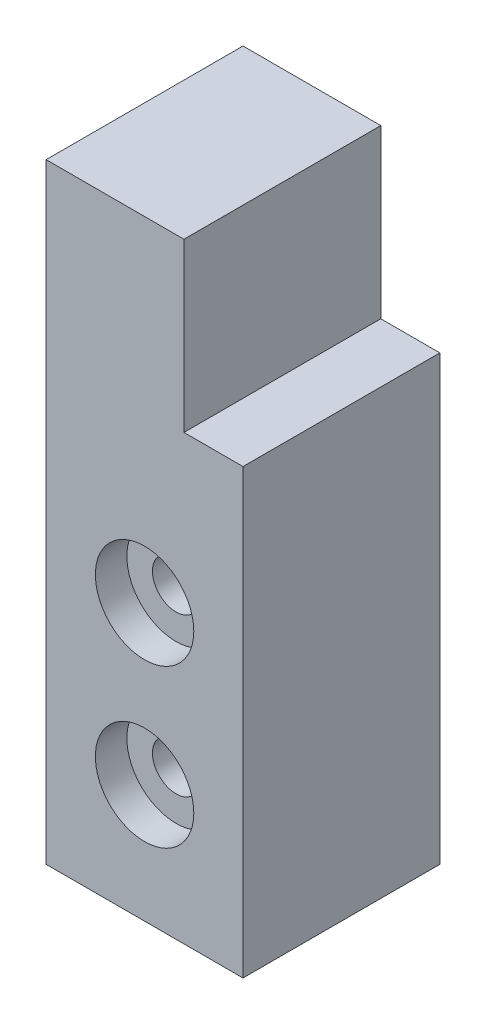
ISO-10303-21;
HEADER;
FILE_DESCRIPTION(('STEP AP214'),'2;1');
FILE_NAME('part.step','',(''),(''),'','','');
FILE_SCHEMA(('AUTOMOTIVE_DESIGN { 1 0 10303 214 1 1 1 1 }'));
ENDSEC;
DATA;
#1=APPLICATION_CONTEXT('core data for automotive mechanical design processes');
#2=APPLICATION_PROTOCOL_DEFINITION('international standard','automotive_design',2000,#1);
#3=PRODUCT_CONTEXT('',#1,'mechanical');
#4=PRODUCT('Part','Part','',(#3));
#5=PRODUCT_RELATED_PRODUCT_CATEGORY('part','',(#4));
#6=PRODUCT_DEFINITION_FORMATION('','',#4);
#7=PRODUCT_DEFINITION_CONTEXT('part definition',#1,'design');
#8=PRODUCT_DEFINITION('design','',#6,#7);
#9=PRODUCT_DEFINITION_SHAPE('','',#8);
#10=(LENGTH_UNIT() NAMED_UNIT(*) SI_UNIT(.MILLI.,.METRE.));
#11=(NAMED_UNIT(*) PLANE_ANGLE_UNIT() SI_UNIT($,.RADIAN.));
#12=(NAMED_UNIT(*) SI_UNIT($,.STERADIAN.) SOLID_ANGLE_UNIT());
#13=UNCERTAINTY_MEASURE_WITH_UNIT(LENGTH_MEASURE(1.E-05),#10,'distance_accuracy_value','');
#14=(GEOMETRIC_REPRESENTATION_CONTEXT(3) GLOBAL_UNCERTAINTY_ASSIGNED_CONTEXT((#13)) GLOBAL_UNIT_ASSIGNED_CONTEXT((#10,
#11,#12)) REPRESENTATION_CONTEXT('',''));
#15=CARTESIAN_POINT('',(0.,0.,0.));
#16=DIRECTION('',(0.,0.,1.));
#17=DIRECTION('',(1.,0.,0.));
#18=AXIS2_PLACEMENT_3D('',#15,#16,#17);
#19=CARTESIAN_POINT('',(0.,0.,10.));
#20=DIRECTION('',(1.,0.,0.));
#21=DIRECTION('',(0.,0.,-1.));
#22=AXIS2_PLACEMENT_3D('',#19,#20,#21);
#23=PLANE('',#22);
#24=DIRECTION('',(0.,-1.,0.));
#25=VECTOR('',#24,1.);
#26=CARTESIAN_POINT('',(0.,0.,0.));
#27=LINE('',#26,#25);
#28=CARTESIAN_POINT('',(0.,31.,0.));
#29=VERTEX_POINT('',#28);
#30=CARTESIAN_POINT('',(0.,0.,0.));
#31=VERTEX_POINT('',#30);
#32=EDGE_CURVE('E109',#29,#31,#27,.T.);
#33=ORIENTED_EDGE('',*,*,#32,.T.);
#34=DIRECTION('',(0.,0.,-1.));
#35=VECTOR('',#34,1.);
#36=CARTESIAN_POINT('',(0.,0.,10.));
#37=LINE('',#36,#35);
#38=CARTESIAN_POINT('',(0.,0.,10.));
#39=VERTEX_POINT('',#38);
#40=EDGE_CURVE('E11',#39,#31,#37,.T.);
#41=ORIENTED_EDGE('',*,*,#40,.F.);
#42=DIRECTION('',(0.,-1.,0.));
#43=VECTOR('',#42,1.);
#44=CARTESIAN_POINT('',(0.,0.,10.));
#45=LINE('',#44,#43);
#46=CARTESIAN_POINT('',(0.,31.,10.));
#47=VERTEX_POINT('',#46);
#48=EDGE_CURVE('E110',#47,#39,#45,.T.);
#49=ORIENTED_EDGE('',*,*,#48,.F.);
#50=DIRECTION('',(0.,0.,-1.));
#51=VECTOR('',#50,1.);
#52=CARTESIAN_POINT('',(0.,31.,10.));
#53=LINE('',#52,#51);
#54=EDGE_CURVE('E119',#47,#29,#53,.T.);
#55=ORIENTED_EDGE('',*,*,#54,.T.);
#56=EDGE_LOOP('',(#33,#41,#49,#55));
#57=FACE_BOUND('',#56,.T.);
#58=ADVANCED_FACE('F35',(#57),#23,.F.);
#59=CARTESIAN_POINT('',(0.,0.,10.));
#60=DIRECTION('',(0.,1.,0.));
#61=DIRECTION('',(0.,0.,1.));
#62=AXIS2_PLACEMENT_3D('',#59,#60,#61);
#63=PLANE('',#62);
#64=DIRECTION('',(1.,0.,0.));
#65=VECTOR('',#64,1.);
#66=CARTESIAN_POINT('',(0.,0.,0.));
#67=LINE('',#66,#65);
#68=CARTESIAN_POINT('',(10.,0.,0.));
#69=VERTEX_POINT('',#68);
#70=EDGE_CURVE('E115',#31,#69,#67,.T.);
#71=ORIENTED_EDGE('',*,*,#70,.T.);
#72=DIRECTION('',(0.,0.,-1.));
#73=VECTOR('',#72,1.);
#74=CARTESIAN_POINT('',(10.,0.,10.));
#75=LINE('',#74,#73);
#76=CARTESIAN_POINT('',(10.,0.,10.));
#77=VERTEX_POINT('',#76);
#78=EDGE_CURVE('E42',#77,#69,#75,.T.);
#79=ORIENTED_EDGE('',*,*,#78,.F.);
#80=DIRECTION('',(1.,0.,0.));
#81=VECTOR('',#80,1.);
#82=CARTESIAN_POINT('',(0.,0.,10.));
#83=LINE('',#82,#81);
#84=EDGE_CURVE('E81',#39,#77,#83,.T.);
#85=ORIENTED_EDGE('',*,*,#84,.F.);
#86=ORIENTED_EDGE('',*,*,#40,.T.);
#87=EDGE_LOOP('',(#71,#79,#85,#86));
#88=FACE_BOUND('',#87,.T.);
#89=ADVANCED_FACE('F141',(#88),#63,.F.);
#90=CARTESIAN_POINT('',(10.,0.,10.));
#91=DIRECTION('',(-1.,0.,0.));
#92=DIRECTION('',(0.,0.,1.));
#93=AXIS2_PLACEMENT_3D('',#90,#91,#92);
#94=PLANE('',#93);
#95=DIRECTION('',(0.,1.,0.));
#96=VECTOR('',#95,1.);
#97=CARTESIAN_POINT('',(10.,0.,0.));
#98=LINE('',#97,#96);
#99=CARTESIAN_POINT('',(10.,22.5,0.));
#100=VERTEX_POINT('',#99);
#101=EDGE_CURVE('E111',#69,#100,#98,.T.);
#102=ORIENTED_EDGE('',*,*,#101,.T.);
#103=DIRECTION('',(0.,0.,1.));
#104=VECTOR('',#103,1.);
#105=CARTESIAN_POINT('',(10.,22.5,0.));
#106=LINE('',#105,#104);
#107=CARTESIAN_POINT('',(10.,22.5,10.));
#108=VERTEX_POINT('',#107);
#109=EDGE_CURVE('E135',#100,#108,#106,.T.);
#110=ORIENTED_EDGE('',*,*,#109,.T.);
#111=DIRECTION('',(0.,1.,0.));
#112=VECTOR('',#111,1.);
#113=CARTESIAN_POINT('',(10.,0.,10.));
#114=LINE('',#113,#112);
#115=EDGE_CURVE('E127',#77,#108,#114,.T.);
#116=ORIENTED_EDGE('',*,*,#115,.F.);
#117=ORIENTED_EDGE('',*,*,#78,.T.);
#118=EDGE_LOOP('',(#102,#110,#116,#117));
#119=FACE_BOUND('',#118,.T.);
#120=ADVANCED_FACE('F124',(#119),#94,.F.);
#121=CARTESIAN_POINT('',(0.,31.,10.));
#122=DIRECTION('',(0.,-1.,0.));
#123=DIRECTION('',(0.,0.,-1.));
#124=AXIS2_PLACEMENT_3D('',#121,#122,#123);
#125=PLANE('',#124);
#126=DIRECTION('',(-1.,0.,0.));
#127=VECTOR('',#126,1.);
#128=CARTESIAN_POINT('',(0.,31.,10.));
#129=LINE('',#128,#127);
#130=CARTESIAN_POINT('',(7.,31.,10.));
#131=VERTEX_POINT('',#130);
#132=EDGE_CURVE('E58',#131,#47,#129,.T.);
#133=ORIENTED_EDGE('',*,*,#132,.F.);
#134=DIRECTION('',(0.,0.,1.));
#135=VECTOR('',#134,1.);
#136=CARTESIAN_POINT('',(7.,31.,0.));
#137=LINE('',#136,#135);
#138=CARTESIAN_POINT('',(7.,31.,0.));
#139=VERTEX_POINT('',#138);
#140=EDGE_CURVE('E99',#139,#131,#137,.T.);
#141=ORIENTED_EDGE('',*,*,#140,.F.);
#142=DIRECTION('',(-1.,0.,0.));
#143=VECTOR('',#142,1.);
#144=CARTESIAN_POINT('',(0.,31.,0.));
#145=LINE('',#144,#143);
#146=EDGE_CURVE('E76',#139,#29,#145,.T.);
#147=ORIENTED_EDGE('',*,*,#146,.T.);
#148=ORIENTED_EDGE('',*,*,#54,.F.);
#149=EDGE_LOOP('',(#133,#141,#147,#148));
#150=FACE_BOUND('',#149,.T.);
#151=ADVANCED_FACE('F104',(#150),#125,.F.);
#152=CARTESIAN_POINT('',(0.,0.,10.));
#153=DIRECTION('',(0.,0.,-1.));
#154=DIRECTION('',(-1.,0.,0.));
#155=AXIS2_PLACEMENT_3D('',#152,#153,#154);
#156=PLANE('',#155);
#157=CARTESIAN_POINT('',(5.,14.,10.));
#158=DIRECTION('',(0.,0.,1.));
#159=DIRECTION('',(1.,0.,0.));
#160=AXIS2_PLACEMENT_3D('',#157,#158,#159);
#161=CIRCLE('',#160,2.5);
#162=CARTESIAN_POINT('',(7.5,14.,10.));
#163=VERTEX_POINT('',#162);
#164=EDGE_CURVE('E177',#163,#163,#161,.T.);
#165=ORIENTED_EDGE('',*,*,#164,.F.);
#166=EDGE_LOOP('',(#165));
#167=FACE_BOUND('',#166,.T.);
#168=CARTESIAN_POINT('',(5.,6.,10.));
#169=DIRECTION('',(0.,0.,1.));
#170=DIRECTION('',(1.,0.,0.));
#171=AXIS2_PLACEMENT_3D('',#168,#169,#170);
#172=CIRCLE('',#171,2.5);
#173=CARTESIAN_POINT('',(7.5,6.,10.));
#174=VERTEX_POINT('',#173);
#175=EDGE_CURVE('E180',#174,#174,#172,.T.);
#176=ORIENTED_EDGE('',*,*,#175,.F.);
#177=EDGE_LOOP('',(#176));
#178=FACE_BOUND('',#177,.T.);
#179=ORIENTED_EDGE('',*,*,#115,.T.);
#180=DIRECTION('',(1.,0.,0.));
#181=VECTOR('',#180,1.);
#182=CARTESIAN_POINT('',(10.,22.5,10.));
#183=LINE('',#182,#181);
#184=CARTESIAN_POINT('',(7.,22.5,10.));
#185=VERTEX_POINT('',#184);
#186=EDGE_CURVE('E102',#185,#108,#183,.T.);
#187=ORIENTED_EDGE('',*,*,#186,.F.);
#188=DIRECTION('',(0.,-1.,0.));
#189=VECTOR('',#188,1.);
#190=CARTESIAN_POINT('',(7.,31.,10.));
#191=LINE('',#190,#189);
#192=EDGE_CURVE('E131',#131,#185,#191,.T.);
#193=ORIENTED_EDGE('',*,*,#192,.F.);
#194=ORIENTED_EDGE('',*,*,#132,.T.);
#195=ORIENTED_EDGE('',*,*,#48,.T.);
#196=ORIENTED_EDGE('',*,*,#84,.T.);
#197=EDGE_LOOP('',(#179,#187,#193,#194,#195,#196));
#198=FACE_BOUND('',#197,.T.);
#199=ADVANCED_FACE('F145',(#167,#178,#198),#156,.F.);
#200=CARTESIAN_POINT('',(0.,0.,0.));
#201=DIRECTION('',(0.,0.,-1.));
#202=DIRECTION('',(-1.,0.,0.));
#203=AXIS2_PLACEMENT_3D('',#200,#201,#202);
#204=PLANE('',#203);
#205=CARTESIAN_POINT('',(5.,14.,0.));
#206=DIRECTION('',(0.,0.,1.));
#207=DIRECTION('',(1.,0.,0.));
#208=AXIS2_PLACEMENT_3D('',#205,#206,#207);
#209=CIRCLE('',#208,1.2);
#210=CARTESIAN_POINT('',(6.2,14.,0.));
#211=VERTEX_POINT('',#210);
#212=EDGE_CURVE('E183',#211,#211,#209,.T.);
#213=ORIENTED_EDGE('',*,*,#212,.T.);
#214=EDGE_LOOP('',(#213));
#215=FACE_BOUND('',#214,.T.);
#216=CARTESIAN_POINT('',(5.,6.,0.));
#217=DIRECTION('',(0.,0.,1.));
#218=DIRECTION('',(1.,0.,0.));
#219=AXIS2_PLACEMENT_3D('',#216,#217,#218);
#220=CIRCLE('',#219,1.2);
#221=CARTESIAN_POINT('',(6.2,6.,0.));
#222=VERTEX_POINT('',#221);
#223=EDGE_CURVE('E133',#222,#222,#220,.T.);
#224=ORIENTED_EDGE('',*,*,#223,.T.);
#225=EDGE_LOOP('',(#224));
#226=FACE_BOUND('',#225,.T.);
#227=DIRECTION('',(1.,0.,0.));
#228=VECTOR('',#227,1.);
#229=CARTESIAN_POINT('',(10.,22.5,0.));
#230=LINE('',#229,#228);
#231=CARTESIAN_POINT('',(7.,22.5,0.));
#232=VERTEX_POINT('',#231);
#233=EDGE_CURVE('E49',#232,#100,#230,.T.);
#234=ORIENTED_EDGE('',*,*,#233,.T.);
#235=ORIENTED_EDGE('',*,*,#101,.F.);
#236=ORIENTED_EDGE('',*,*,#70,.F.);
#237=ORIENTED_EDGE('',*,*,#32,.F.);
#238=ORIENTED_EDGE('',*,*,#146,.F.);
#239=DIRECTION('',(0.,-1.,0.));
#240=VECTOR('',#239,1.);
#241=CARTESIAN_POINT('',(7.,31.,0.));
#242=LINE('',#241,#240);
#243=EDGE_CURVE('E96',#139,#232,#242,.T.);
#244=ORIENTED_EDGE('',*,*,#243,.T.);
#245=EDGE_LOOP('',(#234,#235,#236,#237,#238,#244));
#246=FACE_BOUND('',#245,.T.);
#247=ADVANCED_FACE('F107',(#215,#226,#246),#204,.T.);
#248=CARTESIAN_POINT('',(10.,22.5,0.));
#249=DIRECTION('',(0.,-1.,0.));
#250=DIRECTION('',(0.,0.,-1.));
#251=AXIS2_PLACEMENT_3D('',#248,#249,#250);
#252=PLANE('',#251);
#253=ORIENTED_EDGE('',*,*,#186,.T.);
#254=ORIENTED_EDGE('',*,*,#109,.F.);
#255=ORIENTED_EDGE('',*,*,#233,.F.);
#256=DIRECTION('',(0.,0.,1.));
#257=VECTOR('',#256,1.);
#258=CARTESIAN_POINT('',(7.,22.5,0.));
#259=LINE('',#258,#257);
#260=EDGE_CURVE('E100',#232,#185,#259,.T.);
#261=ORIENTED_EDGE('',*,*,#260,.T.);
#262=EDGE_LOOP('',(#253,#254,#255,#261));
#263=FACE_BOUND('',#262,.T.);
#264=ADVANCED_FACE('F147',(#263),#252,.F.);
#265=CARTESIAN_POINT('',(7.,31.,0.));
#266=DIRECTION('',(-1.,0.,0.));
#267=DIRECTION('',(0.,-1.,0.));
#268=AXIS2_PLACEMENT_3D('',#265,#266,#267);
#269=PLANE('',#268);
#270=ORIENTED_EDGE('',*,*,#192,.T.);
#271=ORIENTED_EDGE('',*,*,#260,.F.);
#272=ORIENTED_EDGE('',*,*,#243,.F.);
#273=ORIENTED_EDGE('',*,*,#140,.T.);
#274=EDGE_LOOP('',(#270,#271,#272,#273));
#275=FACE_BOUND('',#274,.T.);
#276=ADVANCED_FACE('F98',(#275),#269,.F.);
#277=CARTESIAN_POINT('',(5.,6.,10.));
#278=DIRECTION('',(0.,0.,1.));
#279=DIRECTION('',(1.,0.,0.));
#280=AXIS2_PLACEMENT_3D('',#277,#278,#279);
#281=CYLINDRICAL_SURFACE('',#280,1.2);
#282=ORIENTED_EDGE('',*,*,#223,.F.);
#283=EDGE_LOOP('',(#282));
#284=FACE_BOUND('',#283,.T.);
#285=CARTESIAN_POINT('',(5.,6.,8.4));
#286=DIRECTION('',(0.,0.,1.));
#287=DIRECTION('',(1.,0.,0.));
#288=AXIS2_PLACEMENT_3D('',#285,#286,#287);
#289=CIRCLE('',#288,1.2);
#290=CARTESIAN_POINT('',(6.2,6.,8.4));
#291=VERTEX_POINT('',#290);
#292=EDGE_CURVE('E186',#291,#291,#289,.T.);
#293=ORIENTED_EDGE('',*,*,#292,.T.);
#294=EDGE_LOOP('',(#293));
#295=FACE_BOUND('',#294,.T.);
#296=ADVANCED_FACE('F154',(#284,#295),#281,.F.);
#297=CARTESIAN_POINT('',(6.2,6.,8.4));
#298=DIRECTION('',(0.,0.,-1.));
#299=DIRECTION('',(-1.,0.,0.));
#300=AXIS2_PLACEMENT_3D('',#297,#298,#299);
#301=PLANE('',#300);
#302=ORIENTED_EDGE('',*,*,#292,.F.);
#303=EDGE_LOOP('',(#302));
#304=FACE_BOUND('',#303,.T.);
#305=CARTESIAN_POINT('',(5.,6.,8.4));
#306=DIRECTION('',(0.,0.,1.));
#307=DIRECTION('',(1.,0.,0.));
#308=AXIS2_PLACEMENT_3D('',#305,#306,#307);
#309=CIRCLE('',#308,2.5);
#310=CARTESIAN_POINT('',(7.5,6.,8.4));
#311=VERTEX_POINT('',#310);
#312=EDGE_CURVE('E182',#311,#311,#309,.T.);
#313=ORIENTED_EDGE('',*,*,#312,.T.);
#314=EDGE_LOOP('',(#313));
#315=FACE_BOUND('',#314,.T.);
#316=ADVANCED_FACE('F200',(#304,#315),#301,.F.);
#317=CARTESIAN_POINT('',(5.,6.,10.));
#318=DIRECTION('',(0.,0.,1.));
#319=DIRECTION('',(1.,0.,0.));
#320=AXIS2_PLACEMENT_3D('',#317,#318,#319);
#321=CYLINDRICAL_SURFACE('',#320,2.5);
#322=ORIENTED_EDGE('',*,*,#312,.F.);
#323=EDGE_LOOP('',(#322));
#324=FACE_BOUND('',#323,.T.);
#325=ORIENTED_EDGE('',*,*,#175,.T.);
#326=EDGE_LOOP('',(#325));
#327=FACE_BOUND('',#326,.T.);
#328=ADVANCED_FACE('F205',(#324,#327),#321,.F.);
#329=CARTESIAN_POINT('',(5.,14.,10.));
#330=DIRECTION('',(0.,0.,1.));
#331=DIRECTION('',(1.,0.,0.));
#332=AXIS2_PLACEMENT_3D('',#329,#330,#331);
#333=CYLINDRICAL_SURFACE('',#332,1.2);
#334=ORIENTED_EDGE('',*,*,#212,.F.);
#335=EDGE_LOOP('',(#334));
#336=FACE_BOUND('',#335,.T.);
#337=CARTESIAN_POINT('',(5.,14.,8.4));
#338=DIRECTION('',(0.,0.,1.));
#339=DIRECTION('',(1.,0.,0.));
#340=AXIS2_PLACEMENT_3D('',#337,#338,#339);
#341=CIRCLE('',#340,1.2);
#342=CARTESIAN_POINT('',(6.2,14.,8.4));
#343=VERTEX_POINT('',#342);
#344=EDGE_CURVE('E189',#343,#343,#341,.T.);
#345=ORIENTED_EDGE('',*,*,#344,.T.);
#346=EDGE_LOOP('',(#345));
#347=FACE_BOUND('',#346,.T.);
#348=ADVANCED_FACE('F210',(#336,#347),#333,.F.);
#349=CARTESIAN_POINT('',(6.2,14.,8.4));
#350=DIRECTION('',(0.,0.,-1.));
#351=DIRECTION('',(-1.,0.,0.));
#352=AXIS2_PLACEMENT_3D('',#349,#350,#351);
#353=PLANE('',#352);
#354=ORIENTED_EDGE('',*,*,#344,.F.);
#355=EDGE_LOOP('',(#354));
#356=FACE_BOUND('',#355,.T.);
#357=CARTESIAN_POINT('',(5.,14.,8.4));
#358=DIRECTION('',(0.,0.,1.));
#359=DIRECTION('',(1.,0.,0.));
#360=AXIS2_PLACEMENT_3D('',#357,#358,#359);
#361=CIRCLE('',#360,2.5);
#362=CARTESIAN_POINT('',(7.5,14.,8.4));
#363=VERTEX_POINT('',#362);
#364=EDGE_CURVE('E230',#363,#363,#361,.T.);
#365=ORIENTED_EDGE('',*,*,#364,.T.);
#366=EDGE_LOOP('',(#365));
#367=FACE_BOUND('',#366,.T.);
#368=ADVANCED_FACE('F215',(#356,#367),#353,.F.);
#369=CARTESIAN_POINT('',(5.,14.,10.));
#370=DIRECTION('',(0.,0.,1.));
#371=DIRECTION('',(1.,0.,0.));
#372=AXIS2_PLACEMENT_3D('',#369,#370,#371);
#373=CYLINDRICAL_SURFACE('',#372,2.5);
#374=ORIENTED_EDGE('',*,*,#364,.F.);
#375=EDGE_LOOP('',(#374));
#376=FACE_BOUND('',#375,.T.);
#377=ORIENTED_EDGE('',*,*,#164,.T.);
#378=EDGE_LOOP('',(#377));
#379=FACE_BOUND('',#378,.T.);
#380=ADVANCED_FACE('F221',(#376,#379),#373,.F.);
#381=CLOSED_SHELL('',(#58,#89,#120,#151,#199,#247,#264,#276,#296,#316,#328,#348,#368,#380));
#382=MANIFOLD_SOLID_BREP('B2',#381);
#383=ADVANCED_BREP_SHAPE_REPRESENTATION('',(#18,#382),#14);
#384=SHAPE_DEFINITION_REPRESENTATION(#9,#383);
ENDSEC;
END-ISO-10303-21;
